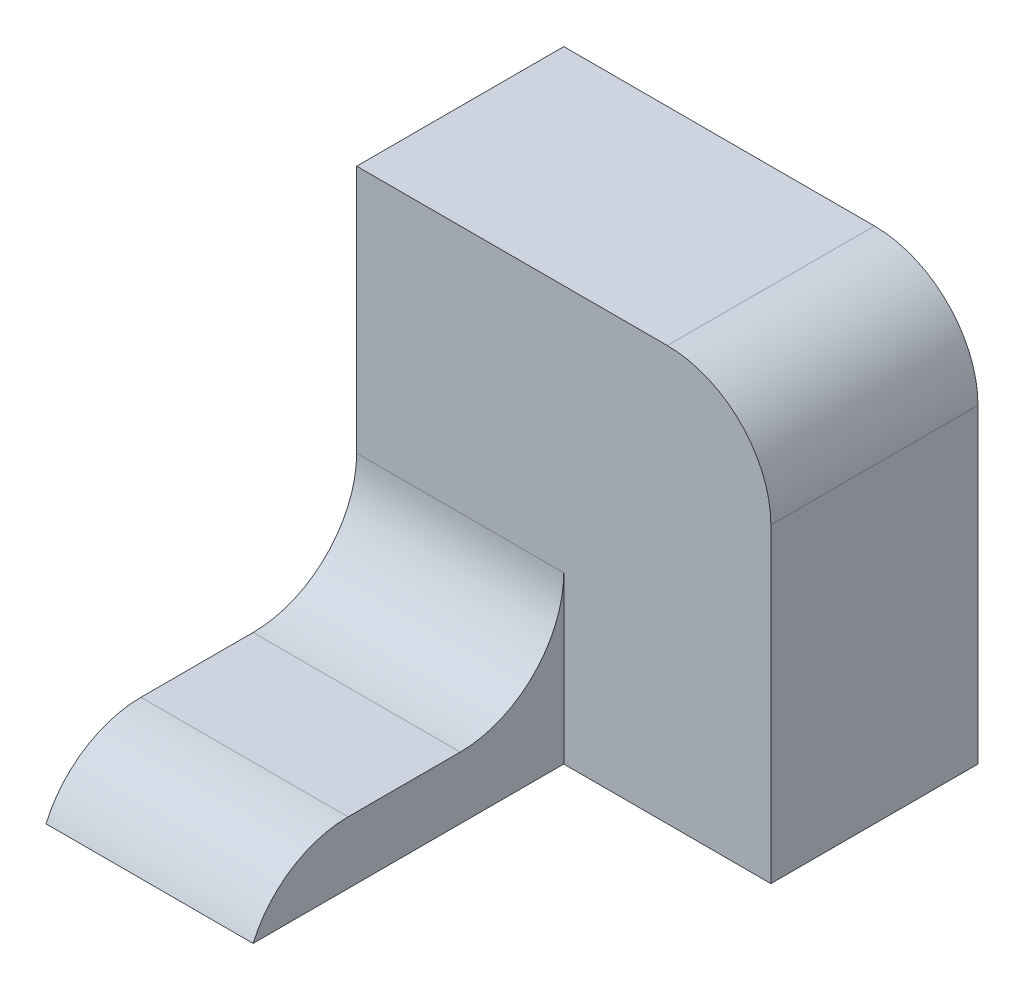
ISO-10303-21;
HEADER;
FILE_DESCRIPTION(('STEP AP214'),'2;1');
FILE_NAME('part.step','',(''),(''),'','','');
FILE_SCHEMA(('AUTOMOTIVE_DESIGN { 1 0 10303 214 1 1 1 1 }'));
ENDSEC;
DATA;
#1=APPLICATION_CONTEXT('core data for automotive mechanical design processes');
#2=APPLICATION_PROTOCOL_DEFINITION('international standard','automotive_design',2000,#1);
#3=PRODUCT_CONTEXT('',#1,'mechanical');
#4=PRODUCT('Part','Part','',(#3));
#5=PRODUCT_RELATED_PRODUCT_CATEGORY('part','',(#4));
#6=PRODUCT_DEFINITION_FORMATION('','',#4);
#7=PRODUCT_DEFINITION_CONTEXT('part definition',#1,'design');
#8=PRODUCT_DEFINITION('design','',#6,#7);
#9=PRODUCT_DEFINITION_SHAPE('','',#8);
#10=(LENGTH_UNIT() NAMED_UNIT(*) SI_UNIT(.MILLI.,.METRE.));
#11=(NAMED_UNIT(*) PLANE_ANGLE_UNIT() SI_UNIT($,.RADIAN.));
#12=(NAMED_UNIT(*) SI_UNIT($,.STERADIAN.) SOLID_ANGLE_UNIT());
#13=UNCERTAINTY_MEASURE_WITH_UNIT(LENGTH_MEASURE(1.E-05),#10,'distance_accuracy_value','');
#14=(GEOMETRIC_REPRESENTATION_CONTEXT(3) GLOBAL_UNCERTAINTY_ASSIGNED_CONTEXT((#13)) GLOBAL_UNIT_ASSIGNED_CONTEXT((#10,
#11,#12)) REPRESENTATION_CONTEXT('',''));
#15=CARTESIAN_POINT('',(0.,0.,0.));
#16=DIRECTION('',(0.,0.,1.));
#17=DIRECTION('',(1.,0.,0.));
#18=AXIS2_PLACEMENT_3D('',#15,#16,#17);
#19=CARTESIAN_POINT('',(-10.,0.,30.));
#20=DIRECTION('',(0.,-1.,0.));
#21=DIRECTION('',(1.,0.,0.));
#22=AXIS2_PLACEMENT_3D('',#19,#20,#21);
#23=PLANE('',#22);
#24=DIRECTION('',(0.,0.,-1.));
#25=VECTOR('',#24,1.);
#26=CARTESIAN_POINT('',(-10.,0.,30.));
#27=LINE('',#26,#25);
#28=CARTESIAN_POINT('',(-10.,0.,20.8348486100883));
#29=VERTEX_POINT('',#28);
#30=CARTESIAN_POINT('',(-10.,0.,10.));
#31=VERTEX_POINT('',#30);
#32=EDGE_CURVE('E144',#29,#31,#27,.T.);
#33=ORIENTED_EDGE('',*,*,#32,.T.);
#34=DIRECTION('',(-1.,0.,0.));
#35=VECTOR('',#34,1.);
#36=CARTESIAN_POINT('',(-10.,0.,10.));
#37=LINE('',#36,#35);
#38=CARTESIAN_POINT('',(-30.,0.,10.));
#39=VERTEX_POINT('',#38);
#40=EDGE_CURVE('E158',#31,#39,#37,.T.);
#41=ORIENTED_EDGE('',*,*,#40,.T.);
#42=DIRECTION('',(0.,0.,-1.));
#43=VECTOR('',#42,1.);
#44=CARTESIAN_POINT('',(-30.,0.,30.));
#45=LINE('',#44,#43);
#46=CARTESIAN_POINT('',(-30.,0.,20.8348486100883));
#47=VERTEX_POINT('',#46);
#48=EDGE_CURVE('E153',#47,#39,#45,.T.);
#49=ORIENTED_EDGE('',*,*,#48,.F.);
#50=DIRECTION('',(-1.,0.,0.));
#51=VECTOR('',#50,1.);
#52=CARTESIAN_POINT('',(-10.,0.,20.8348486100883));
#53=LINE('',#52,#51);
#54=EDGE_CURVE('E156',#47,#29,#53,.F.);
#55=ORIENTED_EDGE('',*,*,#54,.T.);
#56=EDGE_LOOP('',(#33,#41,#49,#55));
#57=FACE_BOUND('',#56,.T.);
#58=ADVANCED_FACE('F35',(#57),#23,.F.);
#59=CARTESIAN_POINT('',(-30.,0.,30.));
#60=DIRECTION('',(1.,0.,0.));
#61=DIRECTION('',(0.,0.,-1.));
#62=AXIS2_PLACEMENT_3D('',#59,#60,#61);
#63=PLANE('',#62);
#64=DIRECTION('',(0.,0.,-1.));
#65=VECTOR('',#64,1.);
#66=CARTESIAN_POINT('',(-30.,-6.,30.));
#67=LINE('',#66,#65);
#68=CARTESIAN_POINT('',(-30.,-6.,30.));
#69=VERTEX_POINT('',#68);
#70=CARTESIAN_POINT('',(-30.,-6.,-20.));
#71=VERTEX_POINT('',#70);
#72=EDGE_CURVE('E151',#69,#71,#67,.T.);
#73=ORIENTED_EDGE('',*,*,#72,.F.);
#74=CARTESIAN_POINT('',(-30.,-10.,20.8348486100883));
#75=DIRECTION('',(1.,0.,0.));
#76=DIRECTION('',(0.,0.,-1.));
#77=AXIS2_PLACEMENT_3D('',#74,#75,#76);
#78=CIRCLE('',#77,10.);
#79=EDGE_CURVE('E171',#69,#47,#78,.F.);
#80=ORIENTED_EDGE('',*,*,#79,.T.);
#81=ORIENTED_EDGE('',*,*,#48,.T.);
#82=CARTESIAN_POINT('',(-30.,10.,10.));
#83=DIRECTION('',(1.,0.,0.));
#84=DIRECTION('',(0.,0.,-1.));
#85=AXIS2_PLACEMENT_3D('',#82,#83,#84);
#86=CIRCLE('',#85,10.);
#87=CARTESIAN_POINT('',(-30.,10.,0.));
#88=VERTEX_POINT('',#87);
#89=EDGE_CURVE('E43',#39,#88,#86,.T.);
#90=ORIENTED_EDGE('',*,*,#89,.T.);
#91=DIRECTION('',(0.,-1.,0.));
#92=VECTOR('',#91,1.);
#93=CARTESIAN_POINT('',(-30.,34.,0.));
#94=LINE('',#93,#92);
#95=CARTESIAN_POINT('',(-30.,34.,0.));
#96=VERTEX_POINT('',#95);
#97=EDGE_CURVE('E119',#96,#88,#94,.T.);
#98=ORIENTED_EDGE('',*,*,#97,.F.);
#99=DIRECTION('',(0.,0.,1.));
#100=VECTOR('',#99,1.);
#101=CARTESIAN_POINT('',(-30.,34.,-20.));
#102=LINE('',#101,#100);
#103=CARTESIAN_POINT('',(-30.,34.,-20.));
#104=VERTEX_POINT('',#103);
#105=EDGE_CURVE('E108',#104,#96,#102,.T.);
#106=ORIENTED_EDGE('',*,*,#105,.F.);
#107=DIRECTION('',(0.,-1.,0.));
#108=VECTOR('',#107,1.);
#109=CARTESIAN_POINT('',(-30.,34.,-20.));
#110=LINE('',#109,#108);
#111=EDGE_CURVE('E111',#104,#71,#110,.T.);
#112=ORIENTED_EDGE('',*,*,#111,.T.);
#113=EDGE_LOOP('',(#73,#80,#81,#90,#98,#106,#112));
#114=FACE_BOUND('',#113,.T.);
#115=ADVANCED_FACE('F117',(#114),#63,.F.);
#116=CARTESIAN_POINT('',(-30.,-6.,30.));
#117=DIRECTION('',(0.,1.,0.));
#118=DIRECTION('',(0.,0.,1.));
#119=AXIS2_PLACEMENT_3D('',#116,#117,#118);
#120=PLANE('',#119);
#121=ORIENTED_EDGE('',*,*,#72,.T.);
#122=DIRECTION('',(1.,0.,0.));
#123=VECTOR('',#122,1.);
#124=CARTESIAN_POINT('',(-30.,-6.,-20.));
#125=LINE('',#124,#123);
#126=CARTESIAN_POINT('',(10.,-6.,-20.));
#127=VERTEX_POINT('',#126);
#128=EDGE_CURVE('E126',#71,#127,#125,.T.);
#129=ORIENTED_EDGE('',*,*,#128,.T.);
#130=DIRECTION('',(0.,0.,1.));
#131=VECTOR('',#130,1.);
#132=CARTESIAN_POINT('',(10.,-6.,-20.));
#133=LINE('',#132,#131);
#134=CARTESIAN_POINT('',(10.,-6.,0.));
#135=VERTEX_POINT('',#134);
#136=EDGE_CURVE('E120',#127,#135,#133,.T.);
#137=ORIENTED_EDGE('',*,*,#136,.T.);
#138=DIRECTION('',(1.,0.,0.));
#139=VECTOR('',#138,1.);
#140=CARTESIAN_POINT('',(-30.,-6.,0.));
#141=LINE('',#140,#139);
#142=CARTESIAN_POINT('',(-10.,-6.,0.));
#143=VERTEX_POINT('',#142);
#144=EDGE_CURVE('E134',#143,#135,#141,.T.);
#145=ORIENTED_EDGE('',*,*,#144,.F.);
#146=DIRECTION('',(0.,0.,-1.));
#147=VECTOR('',#146,1.);
#148=CARTESIAN_POINT('',(-10.,-6.,30.));
#149=LINE('',#148,#147);
#150=CARTESIAN_POINT('',(-10.,-6.,30.));
#151=VERTEX_POINT('',#150);
#152=EDGE_CURVE('E148',#151,#143,#149,.T.);
#153=ORIENTED_EDGE('',*,*,#152,.F.);
#154=DIRECTION('',(1.,0.,0.));
#155=VECTOR('',#154,1.);
#156=CARTESIAN_POINT('',(-30.,-6.,30.));
#157=LINE('',#156,#155);
#158=EDGE_CURVE('E141',#69,#151,#157,.T.);
#159=ORIENTED_EDGE('',*,*,#158,.F.);
#160=EDGE_LOOP('',(#121,#129,#137,#145,#153,#159));
#161=FACE_BOUND('',#160,.T.);
#162=ADVANCED_FACE('F193',(#161),#120,.F.);
#163=CARTESIAN_POINT('',(-10.,-6.,30.));
#164=DIRECTION('',(-1.,0.,0.));
#165=DIRECTION('',(0.,0.,1.));
#166=AXIS2_PLACEMENT_3D('',#163,#164,#165);
#167=PLANE('',#166);
#168=ORIENTED_EDGE('',*,*,#32,.F.);
#169=CARTESIAN_POINT('',(-10.,-10.,20.8348486100883));
#170=DIRECTION('',(-1.,0.,0.));
#171=DIRECTION('',(0.,0.,1.));
#172=AXIS2_PLACEMENT_3D('',#169,#170,#171);
#173=CIRCLE('',#172,10.);
#174=EDGE_CURVE('E173',#29,#151,#173,.F.);
#175=ORIENTED_EDGE('',*,*,#174,.T.);
#176=ORIENTED_EDGE('',*,*,#152,.T.);
#177=DIRECTION('',(0.,1.,0.));
#178=VECTOR('',#177,1.);
#179=CARTESIAN_POINT('',(-10.,-6.,0.));
#180=LINE('',#179,#178);
#181=CARTESIAN_POINT('',(-10.,10.,0.));
#182=VERTEX_POINT('',#181);
#183=EDGE_CURVE('E139',#143,#182,#180,.T.);
#184=ORIENTED_EDGE('',*,*,#183,.T.);
#185=CARTESIAN_POINT('',(-10.,10.,10.));
#186=DIRECTION('',(-1.,0.,0.));
#187=DIRECTION('',(0.,0.,1.));
#188=AXIS2_PLACEMENT_3D('',#185,#186,#187);
#189=CIRCLE('',#188,10.);
#190=EDGE_CURVE('E11',#182,#31,#189,.T.);
#191=ORIENTED_EDGE('',*,*,#190,.T.);
#192=EDGE_LOOP('',(#168,#175,#176,#184,#191));
#193=FACE_BOUND('',#192,.T.);
#194=ADVANCED_FACE('F184',(#193),#167,.F.);
#195=CARTESIAN_POINT('',(0.,0.,0.));
#196=DIRECTION('',(0.,0.,1.));
#197=DIRECTION('',(1.,0.,0.));
#198=AXIS2_PLACEMENT_3D('',#195,#196,#197);
#199=PLANE('',#198);
#200=ORIENTED_EDGE('',*,*,#97,.T.);
#201=DIRECTION('',(-1.,0.,0.));
#202=VECTOR('',#201,1.);
#203=CARTESIAN_POINT('',(0.,10.,0.));
#204=LINE('',#203,#202);
#205=EDGE_CURVE('E163',#88,#182,#204,.F.);
#206=ORIENTED_EDGE('',*,*,#205,.T.);
#207=ORIENTED_EDGE('',*,*,#183,.F.);
#208=ORIENTED_EDGE('',*,*,#144,.T.);
#209=DIRECTION('',(0.,1.,0.));
#210=VECTOR('',#209,1.);
#211=CARTESIAN_POINT('',(10.,-6.,0.));
#212=LINE('',#211,#210);
#213=CARTESIAN_POINT('',(10.,24.,0.));
#214=VERTEX_POINT('',#213);
#215=EDGE_CURVE('E112',#135,#214,#212,.T.);
#216=ORIENTED_EDGE('',*,*,#215,.T.);
#217=CARTESIAN_POINT('',(0.,24.,0.));
#218=DIRECTION('',(0.,0.,1.));
#219=DIRECTION('',(1.,0.,0.));
#220=AXIS2_PLACEMENT_3D('',#217,#218,#219);
#221=CIRCLE('',#220,10.);
#222=CARTESIAN_POINT('',(0.,34.,0.));
#223=VERTEX_POINT('',#222);
#224=EDGE_CURVE('E161',#214,#223,#221,.T.);
#225=ORIENTED_EDGE('',*,*,#224,.T.);
#226=DIRECTION('',(-1.,0.,0.));
#227=VECTOR('',#226,1.);
#228=CARTESIAN_POINT('',(10.,34.,0.));
#229=LINE('',#228,#227);
#230=EDGE_CURVE('E131',#223,#96,#229,.T.);
#231=ORIENTED_EDGE('',*,*,#230,.T.);
#232=EDGE_LOOP('',(#200,#206,#207,#208,#216,#225,#231));
#233=FACE_BOUND('',#232,.T.);
#234=ADVANCED_FACE('F179',(#233),#199,.T.);
#235=CARTESIAN_POINT('',(10.,34.,-20.));
#236=DIRECTION('',(0.,1.,0.));
#237=DIRECTION('',(-1.,0.,0.));
#238=AXIS2_PLACEMENT_3D('',#235,#236,#237);
#239=PLANE('',#238);
#240=ORIENTED_EDGE('',*,*,#230,.F.);
#241=DIRECTION('',(0.,0.,1.));
#242=VECTOR('',#241,1.);
#243=CARTESIAN_POINT('',(0.,34.,-20.));
#244=LINE('',#243,#242);
#245=CARTESIAN_POINT('',(0.,34.,-20.));
#246=VERTEX_POINT('',#245);
#247=EDGE_CURVE('E50',#223,#246,#244,.F.);
#248=ORIENTED_EDGE('',*,*,#247,.T.);
#249=DIRECTION('',(-1.,0.,0.));
#250=VECTOR('',#249,1.);
#251=CARTESIAN_POINT('',(10.,34.,-20.));
#252=LINE('',#251,#250);
#253=EDGE_CURVE('E105',#246,#104,#252,.T.);
#254=ORIENTED_EDGE('',*,*,#253,.T.);
#255=ORIENTED_EDGE('',*,*,#105,.T.);
#256=EDGE_LOOP('',(#240,#248,#254,#255));
#257=FACE_BOUND('',#256,.T.);
#258=ADVANCED_FACE('F107',(#257),#239,.T.);
#259=CARTESIAN_POINT('',(10.,-6.,-20.));
#260=DIRECTION('',(1.,0.,0.));
#261=DIRECTION('',(0.,0.,-1.));
#262=AXIS2_PLACEMENT_3D('',#259,#260,#261);
#263=PLANE('',#262);
#264=DIRECTION('',(0.,1.,0.));
#265=VECTOR('',#264,1.);
#266=CARTESIAN_POINT('',(10.,-6.,-20.));
#267=LINE('',#266,#265);
#268=CARTESIAN_POINT('',(10.,24.,-20.));
#269=VERTEX_POINT('',#268);
#270=EDGE_CURVE('E121',#127,#269,#267,.T.);
#271=ORIENTED_EDGE('',*,*,#270,.T.);
#272=DIRECTION('',(0.,0.,1.));
#273=VECTOR('',#272,1.);
#274=CARTESIAN_POINT('',(10.,24.,-20.));
#275=LINE('',#274,#273);
#276=EDGE_CURVE('E166',#269,#214,#275,.T.);
#277=ORIENTED_EDGE('',*,*,#276,.T.);
#278=ORIENTED_EDGE('',*,*,#215,.F.);
#279=ORIENTED_EDGE('',*,*,#136,.F.);
#280=EDGE_LOOP('',(#271,#277,#278,#279));
#281=FACE_BOUND('',#280,.T.);
#282=ADVANCED_FACE('F196',(#281),#263,.T.);
#283=CARTESIAN_POINT('',(0.,0.,-20.));
#284=DIRECTION('',(0.,0.,1.));
#285=DIRECTION('',(1.,0.,0.));
#286=AXIS2_PLACEMENT_3D('',#283,#284,#285);
#287=PLANE('',#286);
#288=ORIENTED_EDGE('',*,*,#253,.F.);
#289=CARTESIAN_POINT('',(0.,24.,-20.));
#290=DIRECTION('',(0.,0.,1.));
#291=DIRECTION('',(1.,0.,0.));
#292=AXIS2_PLACEMENT_3D('',#289,#290,#291);
#293=CIRCLE('',#292,10.);
#294=EDGE_CURVE('E57',#246,#269,#293,.F.);
#295=ORIENTED_EDGE('',*,*,#294,.T.);
#296=ORIENTED_EDGE('',*,*,#270,.F.);
#297=ORIENTED_EDGE('',*,*,#128,.F.);
#298=ORIENTED_EDGE('',*,*,#111,.F.);
#299=EDGE_LOOP('',(#288,#295,#296,#297,#298));
#300=FACE_BOUND('',#299,.T.);
#301=ADVANCED_FACE('F124',(#300),#287,.F.);
#302=CARTESIAN_POINT('',(-10.,10.,10.));
#303=DIRECTION('',(-1.,0.,0.));
#304=DIRECTION('',(0.,-1.,0.));
#305=AXIS2_PLACEMENT_3D('',#302,#303,#304);
#306=CYLINDRICAL_SURFACE('',#305,10.);
#307=ORIENTED_EDGE('',*,*,#190,.F.);
#308=ORIENTED_EDGE('',*,*,#205,.F.);
#309=ORIENTED_EDGE('',*,*,#89,.F.);
#310=ORIENTED_EDGE('',*,*,#40,.F.);
#311=EDGE_LOOP('',(#307,#308,#309,#310));
#312=FACE_BOUND('',#311,.T.);
#313=ADVANCED_FACE('F181',(#312),#306,.F.);
#314=CARTESIAN_POINT('',(0.,24.,-20.));
#315=DIRECTION('',(0.,0.,1.));
#316=DIRECTION('',(1.,0.,0.));
#317=AXIS2_PLACEMENT_3D('',#314,#315,#316);
#318=CYLINDRICAL_SURFACE('',#317,10.);
#319=ORIENTED_EDGE('',*,*,#294,.F.);
#320=ORIENTED_EDGE('',*,*,#247,.F.);
#321=ORIENTED_EDGE('',*,*,#224,.F.);
#322=ORIENTED_EDGE('',*,*,#276,.F.);
#323=EDGE_LOOP('',(#319,#320,#321,#322));
#324=FACE_BOUND('',#323,.T.);
#325=ADVANCED_FACE('F199',(#324),#318,.T.);
#326=CARTESIAN_POINT('',(0.,-10.,20.8348486100883));
#327=DIRECTION('',(-1.,0.,0.));
#328=DIRECTION('',(0.,0.,1.));
#329=AXIS2_PLACEMENT_3D('',#326,#327,#328);
#330=CYLINDRICAL_SURFACE('',#329,10.);
#331=ORIENTED_EDGE('',*,*,#174,.F.);
#332=ORIENTED_EDGE('',*,*,#54,.F.);
#333=ORIENTED_EDGE('',*,*,#79,.F.);
#334=ORIENTED_EDGE('',*,*,#158,.T.);
#335=EDGE_LOOP('',(#331,#332,#333,#334));
#336=FACE_BOUND('',#335,.T.);
#337=ADVANCED_FACE('F37',(#336),#330,.T.);
#338=CLOSED_SHELL('',(#58,#115,#162,#194,#234,#258,#282,#301,#313,#325,#337));
#339=MANIFOLD_SOLID_BREP('B2',#338);
#340=ADVANCED_BREP_SHAPE_REPRESENTATION('',(#18,#339),#14);
#341=SHAPE_DEFINITION_REPRESENTATION(#9,#340);
ENDSEC;
END-ISO-10303-21;
